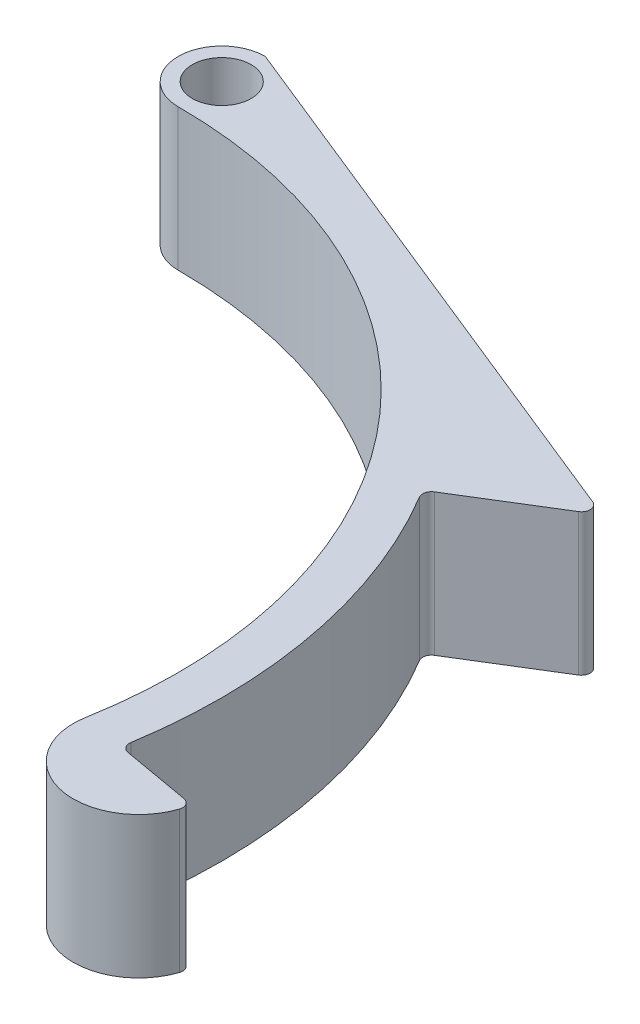
ISO-10303-21;
HEADER;
FILE_DESCRIPTION(('STEP AP214'),'2;1');
FILE_NAME('part.step','',(''),(''),'','','');
FILE_SCHEMA(('AUTOMOTIVE_DESIGN { 1 0 10303 214 1 1 1 1 }'));
ENDSEC;
DATA;
#1=APPLICATION_CONTEXT('core data for automotive mechanical design processes');
#2=APPLICATION_PROTOCOL_DEFINITION('international standard','automotive_design',2000,#1);
#3=PRODUCT_CONTEXT('',#1,'mechanical');
#4=PRODUCT('Part','Part','',(#3));
#5=PRODUCT_RELATED_PRODUCT_CATEGORY('part','',(#4));
#6=PRODUCT_DEFINITION_FORMATION('','',#4);
#7=PRODUCT_DEFINITION_CONTEXT('part definition',#1,'design');
#8=PRODUCT_DEFINITION('design','',#6,#7);
#9=PRODUCT_DEFINITION_SHAPE('','',#8);
#10=(LENGTH_UNIT() NAMED_UNIT(*) SI_UNIT(.MILLI.,.METRE.));
#11=(NAMED_UNIT(*) PLANE_ANGLE_UNIT() SI_UNIT($,.RADIAN.));
#12=(NAMED_UNIT(*) SI_UNIT($,.STERADIAN.) SOLID_ANGLE_UNIT());
#13=UNCERTAINTY_MEASURE_WITH_UNIT(LENGTH_MEASURE(1.E-05),#10,'distance_accuracy_value','');
#14=(GEOMETRIC_REPRESENTATION_CONTEXT(3) GLOBAL_UNCERTAINTY_ASSIGNED_CONTEXT((#13)) GLOBAL_UNIT_ASSIGNED_CONTEXT((#10,
#11,#12)) REPRESENTATION_CONTEXT('',''));
#15=CARTESIAN_POINT('',(0.,0.,0.));
#16=DIRECTION('',(0.,0.,1.));
#17=DIRECTION('',(1.,0.,0.));
#18=AXIS2_PLACEMENT_3D('',#15,#16,#17);
#19=CARTESIAN_POINT('',(0.,13.,0.));
#20=DIRECTION('',(0.,-1.,0.));
#21=DIRECTION('',(0.,0.,-1.));
#22=AXIS2_PLACEMENT_3D('',#19,#20,#21);
#23=CYLINDRICAL_SURFACE('',#22,45.);
#24=CARTESIAN_POINT('',(0.,0.,0.));
#25=DIRECTION('',(0.,1.,0.));
#26=DIRECTION('',(0.,0.,1.));
#27=AXIS2_PLACEMENT_3D('',#24,#25,#26);
#28=CIRCLE('',#27,45.);
#29=CARTESIAN_POINT('',(0.,0.,-45.));
#30=VERTEX_POINT('',#29);
#31=CARTESIAN_POINT('',(44.3163488855494,0.,7.81416799501173));
#32=VERTEX_POINT('',#31);
#33=EDGE_CURVE('E158',#30,#32,#28,.F.);
#34=ORIENTED_EDGE('',*,*,#33,.T.);
#35=DIRECTION('',(0.,-1.,0.));
#36=VECTOR('',#35,1.);
#37=CARTESIAN_POINT('',(44.3163488855494,13.,7.81416799501173));
#38=LINE('',#37,#36);
#39=CARTESIAN_POINT('',(44.3163488855494,13.,7.81416799501173));
#40=VERTEX_POINT('',#39);
#41=EDGE_CURVE('E141',#40,#32,#38,.T.);
#42=ORIENTED_EDGE('',*,*,#41,.F.);
#43=CARTESIAN_POINT('',(0.,13.,0.));
#44=DIRECTION('',(0.,1.,0.));
#45=DIRECTION('',(0.,0.,1.));
#46=AXIS2_PLACEMENT_3D('',#43,#44,#45);
#47=CIRCLE('',#46,45.);
#48=CARTESIAN_POINT('',(0.,13.,-45.));
#49=VERTEX_POINT('',#48);
#50=EDGE_CURVE('E148',#49,#40,#47,.F.);
#51=ORIENTED_EDGE('',*,*,#50,.F.);
#52=DIRECTION('',(0.,-1.,0.));
#53=VECTOR('',#52,1.);
#54=CARTESIAN_POINT('',(0.,13.,-45.));
#55=LINE('',#54,#53);
#56=EDGE_CURVE('E161',#49,#30,#55,.T.);
#57=ORIENTED_EDGE('',*,*,#56,.T.);
#58=EDGE_LOOP('',(#34,#42,#51,#57));
#59=FACE_BOUND('',#58,.T.);
#60=ADVANCED_FACE('F45',(#59),#23,.F.);
#61=CARTESIAN_POINT('',(50.2251954036226,13.,8.85605706101328));
#62=DIRECTION('',(0.,-1.,0.));
#63=DIRECTION('',(0.,0.,-1.));
#64=AXIS2_PLACEMENT_3D('',#61,#62,#63);
#65=CYLINDRICAL_SURFACE('',#64,6.);
#66=CARTESIAN_POINT('',(50.2251954036226,0.,8.85605706101328));
#67=DIRECTION('',(0.,1.,0.));
#68=DIRECTION('',(0.,0.,1.));
#69=AXIS2_PLACEMENT_3D('',#66,#67,#68);
#70=CIRCLE('',#69,6.);
#71=CARTESIAN_POINT('',(55.9034053777983,0.,10.7945955540983));
#72=VERTEX_POINT('',#71);
#73=EDGE_CURVE('E266',#32,#72,#70,.T.);
#74=ORIENTED_EDGE('',*,*,#73,.T.);
#75=DIRECTION('',(0.,-1.,0.));
#76=VECTOR('',#75,1.);
#77=CARTESIAN_POINT('',(55.9034053777983,13.,10.7945955540983));
#78=LINE('',#77,#76);
#79=CARTESIAN_POINT('',(55.9034053777983,13.,10.7945955540983));
#80=VERTEX_POINT('',#79);
#81=EDGE_CURVE('E144',#72,#80,#78,.F.);
#82=ORIENTED_EDGE('',*,*,#81,.T.);
#83=CARTESIAN_POINT('',(50.2251954036226,13.,8.85605706101328));
#84=DIRECTION('',(0.,1.,0.));
#85=DIRECTION('',(0.,0.,1.));
#86=AXIS2_PLACEMENT_3D('',#83,#84,#85);
#87=CIRCLE('',#86,6.);
#88=EDGE_CURVE('E136',#40,#80,#87,.T.);
#89=ORIENTED_EDGE('',*,*,#88,.F.);
#90=ORIENTED_EDGE('',*,*,#41,.T.);
#91=EDGE_LOOP('',(#74,#82,#89,#90));
#92=FACE_BOUND('',#91,.T.);
#93=ADVANCED_FACE('F139',(#92),#65,.T.);
#94=CARTESIAN_POINT('',(0.,13.,0.));
#95=DIRECTION('',(-0.173648177666927,0.,0.984807753012209));
#96=DIRECTION('',(0.984807753012209,0.,0.173648177666927));
#97=AXIS2_PLACEMENT_3D('',#94,#95,#96);
#98=PLANE('',#97);
#99=DIRECTION('',(-0.984807753012209,0.,-0.173648177666927));
#100=VECTOR('',#99,1.);
#101=CARTESIAN_POINT('',(0.,13.,0.));
#102=LINE('',#101,#100);
#103=CARTESIAN_POINT('',(55.2852292567084,13.,9.7482775526105));
#104=VERTEX_POINT('',#103);
#105=CARTESIAN_POINT('',(49.0370976097515,13.,8.6465633642336));
#106=VERTEX_POINT('',#105);
#107=EDGE_CURVE('E147',#104,#106,#102,.T.);
#108=ORIENTED_EDGE('',*,*,#107,.F.);
#109=DIRECTION('',(0.,-1.,0.));
#110=VECTOR('',#109,1.);
#111=CARTESIAN_POINT('',(55.2852292567084,13.,9.7482775526105));
#112=LINE('',#111,#110);
#113=CARTESIAN_POINT('',(55.2852292567084,0.,9.7482775526105));
#114=VERTEX_POINT('',#113);
#115=EDGE_CURVE('E165',#104,#114,#112,.T.);
#116=ORIENTED_EDGE('',*,*,#115,.T.);
#117=DIRECTION('',(-0.984807753012209,0.,-0.173648177666927));
#118=VECTOR('',#117,1.);
#119=CARTESIAN_POINT('',(0.,0.,0.));
#120=LINE('',#119,#118);
#121=CARTESIAN_POINT('',(49.0370976097515,0.,8.6465633642336));
#122=VERTEX_POINT('',#121);
#123=EDGE_CURVE('E240',#114,#122,#120,.T.);
#124=ORIENTED_EDGE('',*,*,#123,.T.);
#125=DIRECTION('',(0.,1.,0.));
#126=VECTOR('',#125,1.);
#127=CARTESIAN_POINT('',(49.0370976097515,13.,8.6465633642336));
#128=LINE('',#127,#126);
#129=EDGE_CURVE('E160',#122,#106,#128,.T.);
#130=ORIENTED_EDGE('',*,*,#129,.T.);
#131=EDGE_LOOP('',(#108,#116,#124,#130));
#132=FACE_BOUND('',#131,.T.);
#133=ADVANCED_FACE('F295',(#132),#98,.F.);
#134=CARTESIAN_POINT('',(0.,13.,0.));
#135=DIRECTION('',(0.,-1.,0.));
#136=DIRECTION('',(0.,0.,-1.));
#137=AXIS2_PLACEMENT_3D('',#134,#135,#136);
#138=CYLINDRICAL_SURFACE('',#137,49.);
#139=CARTESIAN_POINT('',(0.,13.,0.));
#140=DIRECTION('',(0.,1.,0.));
#141=DIRECTION('',(0.,0.,1.));
#142=AXIS2_PLACEMENT_3D('',#139,#140,#141);
#143=CIRCLE('',#142,49.);
#144=CARTESIAN_POINT('',(48.3860399888025,13.,7.73247270942506));
#145=VERTEX_POINT('',#144);
#146=CARTESIAN_POINT('',(42.1148392112088,13.,-25.0467626294103));
#147=VERTEX_POINT('',#146);
#148=EDGE_CURVE('E245',#145,#147,#143,.T.);
#149=ORIENTED_EDGE('',*,*,#148,.F.);
#150=DIRECTION('',(0.,-1.,0.));
#151=VECTOR('',#150,1.);
#152=CARTESIAN_POINT('',(48.3860399888025,13.,7.73247270942506));
#153=LINE('',#152,#151);
#154=CARTESIAN_POINT('',(48.3860399888025,0.,7.73247270942506));
#155=VERTEX_POINT('',#154);
#156=EDGE_CURVE('E194',#145,#155,#153,.T.);
#157=ORIENTED_EDGE('',*,*,#156,.T.);
#158=CARTESIAN_POINT('',(0.,0.,0.));
#159=DIRECTION('',(0.,1.,0.));
#160=DIRECTION('',(0.,0.,1.));
#161=AXIS2_PLACEMENT_3D('',#158,#159,#160);
#162=CIRCLE('',#161,49.);
#163=CARTESIAN_POINT('',(42.1148392112088,0.,-25.0467626294103));
#164=VERTEX_POINT('',#163);
#165=EDGE_CURVE('E228',#155,#164,#162,.T.);
#166=ORIENTED_EDGE('',*,*,#165,.T.);
#167=DIRECTION('',(0.,-1.,0.));
#168=VECTOR('',#167,1.);
#169=CARTESIAN_POINT('',(42.1148392112088,13.,-25.0467626294103));
#170=LINE('',#169,#168);
#171=EDGE_CURVE('E191',#164,#147,#170,.F.);
#172=ORIENTED_EDGE('',*,*,#171,.T.);
#173=EDGE_LOOP('',(#149,#157,#166,#172));
#174=FACE_BOUND('',#173,.T.);
#175=ADVANCED_FACE('F236',(#174),#138,.T.);
#176=CARTESIAN_POINT('',(0.,13.,0.));
#177=DIRECTION('',(0.524899474172595,0.,0.851164227404637));
#178=DIRECTION('',(0.851164227404637,0.,-0.524899474172595));
#179=AXIS2_PLACEMENT_3D('',#176,#177,#178);
#180=PLANE('',#179);
#181=DIRECTION('',(-0.851164227404637,0.,0.524899474172595));
#182=VECTOR('',#181,1.);
#183=CARTESIAN_POINT('',(0.,0.,0.));
#184=LINE('',#183,#182);
#185=CARTESIAN_POINT('',(50.5748997151719,0.,-31.1887382153871));
#186=VERTEX_POINT('',#185);
#187=CARTESIAN_POINT('',(42.3825088434823,0.,-26.1366207481407));
#188=VERTEX_POINT('',#187);
#189=EDGE_CURVE('E230',#186,#188,#184,.T.);
#190=ORIENTED_EDGE('',*,*,#189,.F.);
#191=DIRECTION('',(0.,-1.,0.));
#192=VECTOR('',#191,1.);
#193=CARTESIAN_POINT('',(50.5748997151719,13.,-31.1887382153871));
#194=LINE('',#193,#192);
#195=CARTESIAN_POINT('',(50.5748997151719,13.,-31.1887382153871));
#196=VERTEX_POINT('',#195);
#197=EDGE_CURVE('E213',#186,#196,#194,.F.);
#198=ORIENTED_EDGE('',*,*,#197,.T.);
#199=DIRECTION('',(-0.851164227404637,0.,0.524899474172595));
#200=VECTOR('',#199,1.);
#201=CARTESIAN_POINT('',(0.,13.,0.));
#202=LINE('',#201,#200);
#203=CARTESIAN_POINT('',(42.3825088434823,13.,-26.1366207481407));
#204=VERTEX_POINT('',#203);
#205=EDGE_CURVE('E244',#196,#204,#202,.T.);
#206=ORIENTED_EDGE('',*,*,#205,.T.);
#207=DIRECTION('',(0.,-1.,0.));
#208=VECTOR('',#207,1.);
#209=CARTESIAN_POINT('',(42.3825088434823,13.,-26.1366207481407));
#210=LINE('',#209,#208);
#211=EDGE_CURVE('E209',#204,#188,#210,.T.);
#212=ORIENTED_EDGE('',*,*,#211,.T.);
#213=EDGE_LOOP('',(#190,#198,#206,#212));
#214=FACE_BOUND('',#213,.T.);
#215=ADVANCED_FACE('F247',(#214),#180,.T.);
#216=CARTESIAN_POINT('',(18.4107690922549,13.,-45.5602618405853));
#217=DIRECTION('',(0.374663072776281,0.,-0.927161033422908));
#218=DIRECTION('',(-0.927161033422908,0.,-0.374663072776281));
#219=AXIS2_PLACEMENT_3D('',#216,#217,#218);
#220=PLANE('',#219);
#221=DIRECTION('',(0.927161033422908,0.,0.374663072776281));
#222=VECTOR('',#221,1.);
#223=CARTESIAN_POINT('',(18.4107690922549,0.,-45.5602618405853));
#224=LINE('',#223,#222);
#225=CARTESIAN_POINT('',(0.152578115339287,0.,-52.938343628053));
#226=VERTEX_POINT('',#225);
#227=CARTESIAN_POINT('',(50.4547105940548,0.,-32.6113984240491));
#228=VERTEX_POINT('',#227);
#229=EDGE_CURVE('E274',#226,#228,#224,.T.);
#230=ORIENTED_EDGE('',*,*,#229,.F.);
#231=DIRECTION('',(0.,-1.,0.));
#232=VECTOR('',#231,1.);
#233=CARTESIAN_POINT('',(0.152578115339284,13.,-52.938343628053));
#234=LINE('',#233,#232);
#235=CARTESIAN_POINT('',(0.152578115339287,13.,-52.938343628053));
#236=VERTEX_POINT('',#235);
#237=EDGE_CURVE('E206',#226,#236,#234,.F.);
#238=ORIENTED_EDGE('',*,*,#237,.T.);
#239=DIRECTION('',(0.927161033422908,0.,0.374663072776281));
#240=VECTOR('',#239,1.);
#241=CARTESIAN_POINT('',(18.4107690922549,13.,-45.5602618405853));
#242=LINE('',#241,#240);
#243=CARTESIAN_POINT('',(50.4547105940548,13.,-32.6113984240491));
#244=VERTEX_POINT('',#243);
#245=EDGE_CURVE('E250',#236,#244,#242,.T.);
#246=ORIENTED_EDGE('',*,*,#245,.T.);
#247=DIRECTION('',(0.,-1.,0.));
#248=VECTOR('',#247,1.);
#249=CARTESIAN_POINT('',(50.4547105940548,13.,-32.6113984240491));
#250=LINE('',#249,#248);
#251=EDGE_CURVE('E202',#244,#228,#250,.T.);
#252=ORIENTED_EDGE('',*,*,#251,.T.);
#253=EDGE_LOOP('',(#230,#238,#246,#252));
#254=FACE_BOUND('',#253,.T.);
#255=ADVANCED_FACE('F306',(#254),#220,.T.);
#256=CARTESIAN_POINT('',(0.,13.,-49.));
#257=DIRECTION('',(0.,-1.,0.));
#258=DIRECTION('',(0.,0.,-1.));
#259=AXIS2_PLACEMENT_3D('',#256,#257,#258);
#260=CYLINDRICAL_SURFACE('',#259,2.7);
#261=CARTESIAN_POINT('',(0.,13.,-49.));
#262=DIRECTION('',(0.,1.,0.));
#263=DIRECTION('',(0.,0.,1.));
#264=AXIS2_PLACEMENT_3D('',#261,#262,#263);
#265=CIRCLE('',#264,2.7);
#266=CARTESIAN_POINT('',(0.,13.,-46.3));
#267=VERTEX_POINT('',#266);
#268=EDGE_CURVE('E155',#267,#267,#265,.T.);
#269=ORIENTED_EDGE('',*,*,#268,.T.);
#270=EDGE_LOOP('',(#269));
#271=FACE_BOUND('',#270,.T.);
#272=CARTESIAN_POINT('',(0.,0.,-49.));
#273=DIRECTION('',(0.,1.,0.));
#274=DIRECTION('',(0.,0.,1.));
#275=AXIS2_PLACEMENT_3D('',#272,#273,#274);
#276=CIRCLE('',#275,2.7);
#277=CARTESIAN_POINT('',(0.,0.,-46.3));
#278=VERTEX_POINT('',#277);
#279=EDGE_CURVE('E260',#278,#278,#276,.T.);
#280=ORIENTED_EDGE('',*,*,#279,.F.);
#281=EDGE_LOOP('',(#280));
#282=FACE_BOUND('',#281,.T.);
#283=ADVANCED_FACE('F324',(#271,#282),#260,.F.);
#284=CARTESIAN_POINT('',(0.,13.,-49.));
#285=DIRECTION('',(0.,-1.,0.));
#286=DIRECTION('',(0.,0.,-1.));
#287=AXIS2_PLACEMENT_3D('',#284,#285,#286);
#288=CYLINDRICAL_SURFACE('',#287,4.);
#289=CARTESIAN_POINT('',(0.,13.,-49.));
#290=DIRECTION('',(0.,1.,0.));
#291=DIRECTION('',(0.,0.,1.));
#292=AXIS2_PLACEMENT_3D('',#289,#290,#291);
#293=CIRCLE('',#292,4.);
#294=CARTESIAN_POINT('',(-0.183940428602176,13.,-52.9957685016434));
#295=VERTEX_POINT('',#294);
#296=EDGE_CURVE('E152',#49,#295,#293,.F.);
#297=ORIENTED_EDGE('',*,*,#296,.T.);
#298=DIRECTION('',(0.,-1.,0.));
#299=VECTOR('',#298,1.);
#300=CARTESIAN_POINT('',(-0.183940428602176,13.,-52.9957685016434));
#301=LINE('',#300,#299);
#302=CARTESIAN_POINT('',(-0.183940428602176,0.,-52.9957685016434));
#303=VERTEX_POINT('',#302);
#304=EDGE_CURVE('E198',#295,#303,#301,.T.);
#305=ORIENTED_EDGE('',*,*,#304,.T.);
#306=CARTESIAN_POINT('',(0.,0.,-49.));
#307=DIRECTION('',(0.,1.,0.));
#308=DIRECTION('',(0.,0.,1.));
#309=AXIS2_PLACEMENT_3D('',#306,#307,#308);
#310=CIRCLE('',#309,4.);
#311=EDGE_CURVE('E277',#30,#303,#310,.F.);
#312=ORIENTED_EDGE('',*,*,#311,.F.);
#313=ORIENTED_EDGE('',*,*,#56,.F.);
#314=EDGE_LOOP('',(#297,#305,#312,#313));
#315=FACE_BOUND('',#314,.T.);
#316=ADVANCED_FACE('F299',(#315),#288,.T.);
#317=CARTESIAN_POINT('',(0.,13.,0.));
#318=DIRECTION('',(0.,1.,0.));
#319=DIRECTION('',(0.,0.,1.));
#320=AXIS2_PLACEMENT_3D('',#317,#318,#319);
#321=PLANE('',#320);
#322=ORIENTED_EDGE('',*,*,#268,.F.);
#323=EDGE_LOOP('',(#322));
#324=FACE_BOUND('',#323,.T.);
#325=ORIENTED_EDGE('',*,*,#88,.T.);
#326=CARTESIAN_POINT('',(55.1463107145748,13.,10.5361237550203));
#327=DIRECTION('',(0.,1.,0.));
#328=DIRECTION('',(0.,0.,1.));
#329=AXIS2_PLACEMENT_3D('',#326,#327,#328);
#330=CIRCLE('',#329,0.8);
#331=EDGE_CURVE('E188',#80,#104,#330,.T.);
#332=ORIENTED_EDGE('',*,*,#331,.T.);
#333=ORIENTED_EDGE('',*,*,#107,.T.);
#334=CARTESIAN_POINT('',(49.176016151885,13.,7.85871716182383));
#335=DIRECTION('',(0.,1.,0.));
#336=DIRECTION('',(0.,0.,1.));
#337=AXIS2_PLACEMENT_3D('',#334,#335,#336);
#338=CIRCLE('',#337,0.8);
#339=EDGE_CURVE('E219',#106,#145,#338,.F.);
#340=ORIENTED_EDGE('',*,*,#339,.T.);
#341=ORIENTED_EDGE('',*,*,#148,.T.);
#342=CARTESIAN_POINT('',(42.8024284228204,13.,-25.455689366217));
#343=DIRECTION('',(0.,1.,0.));
#344=DIRECTION('',(0.,0.,1.));
#345=AXIS2_PLACEMENT_3D('',#342,#343,#344);
#346=CIRCLE('',#345,0.8);
#347=EDGE_CURVE('E11',#147,#204,#346,.F.);
#348=ORIENTED_EDGE('',*,*,#347,.T.);
#349=ORIENTED_EDGE('',*,*,#205,.F.);
#350=CARTESIAN_POINT('',(50.1549801358338,13.,-31.8696695973108));
#351=DIRECTION('',(0.,1.,0.));
#352=DIRECTION('',(0.,0.,1.));
#353=AXIS2_PLACEMENT_3D('',#350,#351,#352);
#354=CIRCLE('',#353,0.8);
#355=EDGE_CURVE('E67',#196,#244,#354,.T.);
#356=ORIENTED_EDGE('',*,*,#355,.T.);
#357=ORIENTED_EDGE('',*,*,#245,.F.);
#358=CARTESIAN_POINT('',(-0.147152342881741,13.,-52.1966148013147));
#359=DIRECTION('',(0.,1.,0.));
#360=DIRECTION('',(0.,0.,1.));
#361=AXIS2_PLACEMENT_3D('',#358,#359,#360);
#362=CIRCLE('',#361,0.8);
#363=EDGE_CURVE('E61',#236,#295,#362,.T.);
#364=ORIENTED_EDGE('',*,*,#363,.T.);
#365=ORIENTED_EDGE('',*,*,#296,.F.);
#366=ORIENTED_EDGE('',*,*,#50,.T.);
#367=EDGE_LOOP('',(#325,#332,#333,#340,#341,#348,#349,#356,#357,#364,#365,#366));
#368=FACE_BOUND('',#367,.T.);
#369=ADVANCED_FACE('F151',(#324,#368),#321,.T.);
#370=CARTESIAN_POINT('',(0.,0.,0.));
#371=DIRECTION('',(0.,1.,0.));
#372=DIRECTION('',(0.,0.,1.));
#373=AXIS2_PLACEMENT_3D('',#370,#371,#372);
#374=PLANE('',#373);
#375=ORIENTED_EDGE('',*,*,#279,.T.);
#376=EDGE_LOOP('',(#375));
#377=FACE_BOUND('',#376,.T.);
#378=ORIENTED_EDGE('',*,*,#123,.F.);
#379=CARTESIAN_POINT('',(55.1463107145748,0.,10.5361237550203));
#380=DIRECTION('',(0.,1.,0.));
#381=DIRECTION('',(0.,0.,1.));
#382=AXIS2_PLACEMENT_3D('',#379,#380,#381);
#383=CIRCLE('',#382,0.8);
#384=EDGE_CURVE('E179',#114,#72,#383,.F.);
#385=ORIENTED_EDGE('',*,*,#384,.T.);
#386=ORIENTED_EDGE('',*,*,#73,.F.);
#387=ORIENTED_EDGE('',*,*,#33,.F.);
#388=ORIENTED_EDGE('',*,*,#311,.T.);
#389=CARTESIAN_POINT('',(-0.147152342881741,0.,-52.1966148013147));
#390=DIRECTION('',(0.,1.,0.));
#391=DIRECTION('',(0.,0.,1.));
#392=AXIS2_PLACEMENT_3D('',#389,#390,#391);
#393=CIRCLE('',#392,0.8);
#394=EDGE_CURVE('E176',#303,#226,#393,.F.);
#395=ORIENTED_EDGE('',*,*,#394,.T.);
#396=ORIENTED_EDGE('',*,*,#229,.T.);
#397=CARTESIAN_POINT('',(50.1549801358338,0.,-31.8696695973108));
#398=DIRECTION('',(0.,1.,0.));
#399=DIRECTION('',(0.,0.,1.));
#400=AXIS2_PLACEMENT_3D('',#397,#398,#399);
#401=CIRCLE('',#400,0.8);
#402=EDGE_CURVE('E173',#228,#186,#401,.F.);
#403=ORIENTED_EDGE('',*,*,#402,.T.);
#404=ORIENTED_EDGE('',*,*,#189,.T.);
#405=CARTESIAN_POINT('',(42.8024284228204,0.,-25.455689366217));
#406=DIRECTION('',(0.,1.,0.));
#407=DIRECTION('',(0.,0.,1.));
#408=AXIS2_PLACEMENT_3D('',#405,#406,#407);
#409=CIRCLE('',#408,0.8);
#410=EDGE_CURVE('E54',#188,#164,#409,.T.);
#411=ORIENTED_EDGE('',*,*,#410,.T.);
#412=ORIENTED_EDGE('',*,*,#165,.F.);
#413=CARTESIAN_POINT('',(49.176016151885,0.,7.85871716182383));
#414=DIRECTION('',(0.,1.,0.));
#415=DIRECTION('',(0.,0.,1.));
#416=AXIS2_PLACEMENT_3D('',#413,#414,#415);
#417=CIRCLE('',#416,0.8);
#418=EDGE_CURVE('E216',#155,#122,#417,.T.);
#419=ORIENTED_EDGE('',*,*,#418,.T.);
#420=EDGE_LOOP('',(#378,#385,#386,#387,#388,#395,#396,#403,#404,#411,#412,#419));
#421=FACE_BOUND('',#420,.T.);
#422=ADVANCED_FACE('F227',(#377,#421),#374,.F.);
#423=CARTESIAN_POINT('',(55.1463107145748,13.,10.5361237550203));
#424=DIRECTION('',(0.,-1.,0.));
#425=DIRECTION('',(0.,0.,-1.));
#426=AXIS2_PLACEMENT_3D('',#423,#424,#425);
#427=CYLINDRICAL_SURFACE('',#426,0.8);
#428=ORIENTED_EDGE('',*,*,#331,.F.);
#429=ORIENTED_EDGE('',*,*,#81,.F.);
#430=ORIENTED_EDGE('',*,*,#384,.F.);
#431=ORIENTED_EDGE('',*,*,#115,.F.);
#432=EDGE_LOOP('',(#428,#429,#430,#431));
#433=FACE_BOUND('',#432,.T.);
#434=ADVANCED_FACE('F297',(#433),#427,.T.);
#435=CARTESIAN_POINT('',(49.176016151885,13.,7.85871716182383));
#436=DIRECTION('',(0.,-1.,0.));
#437=DIRECTION('',(0.,0.,-1.));
#438=AXIS2_PLACEMENT_3D('',#435,#436,#437);
#439=CYLINDRICAL_SURFACE('',#438,0.8);
#440=ORIENTED_EDGE('',*,*,#339,.F.);
#441=ORIENTED_EDGE('',*,*,#129,.F.);
#442=ORIENTED_EDGE('',*,*,#418,.F.);
#443=ORIENTED_EDGE('',*,*,#156,.F.);
#444=EDGE_LOOP('',(#440,#441,#442,#443));
#445=FACE_BOUND('',#444,.T.);
#446=ADVANCED_FACE('F294',(#445),#439,.F.);
#447=CARTESIAN_POINT('',(-0.147152342881741,13.,-52.1966148013147));
#448=DIRECTION('',(0.,-1.,0.));
#449=DIRECTION('',(0.,0.,-1.));
#450=AXIS2_PLACEMENT_3D('',#447,#448,#449);
#451=CYLINDRICAL_SURFACE('',#450,0.8);
#452=ORIENTED_EDGE('',*,*,#363,.F.);
#453=ORIENTED_EDGE('',*,*,#237,.F.);
#454=ORIENTED_EDGE('',*,*,#394,.F.);
#455=ORIENTED_EDGE('',*,*,#304,.F.);
#456=EDGE_LOOP('',(#452,#453,#454,#455));
#457=FACE_BOUND('',#456,.T.);
#458=ADVANCED_FACE('F302',(#457),#451,.T.);
#459=CARTESIAN_POINT('',(50.1549801358338,13.,-31.8696695973108));
#460=DIRECTION('',(0.,-1.,0.));
#461=DIRECTION('',(0.,0.,-1.));
#462=AXIS2_PLACEMENT_3D('',#459,#460,#461);
#463=CYLINDRICAL_SURFACE('',#462,0.8);
#464=ORIENTED_EDGE('',*,*,#355,.F.);
#465=ORIENTED_EDGE('',*,*,#197,.F.);
#466=ORIENTED_EDGE('',*,*,#402,.F.);
#467=ORIENTED_EDGE('',*,*,#251,.F.);
#468=EDGE_LOOP('',(#464,#465,#466,#467));
#469=FACE_BOUND('',#468,.T.);
#470=ADVANCED_FACE('F309',(#469),#463,.T.);
#471=CARTESIAN_POINT('',(42.8024284228204,13.,-25.455689366217));
#472=DIRECTION('',(0.,-1.,0.));
#473=DIRECTION('',(0.,0.,-1.));
#474=AXIS2_PLACEMENT_3D('',#471,#472,#473);
#475=CYLINDRICAL_SURFACE('',#474,0.8);
#476=ORIENTED_EDGE('',*,*,#347,.F.);
#477=ORIENTED_EDGE('',*,*,#171,.F.);
#478=ORIENTED_EDGE('',*,*,#410,.F.);
#479=ORIENTED_EDGE('',*,*,#211,.F.);
#480=EDGE_LOOP('',(#476,#477,#478,#479));
#481=FACE_BOUND('',#480,.T.);
#482=ADVANCED_FACE('F47',(#481),#475,.F.);
#483=CLOSED_SHELL('',(#60,#93,#133,#175,#215,#255,#283,#316,#369,#422,#434,#446,#458,#470,#482));
#484=MANIFOLD_SOLID_BREP('B2',#483);
#485=ADVANCED_BREP_SHAPE_REPRESENTATION('',(#18,#484),#14);
#486=SHAPE_DEFINITION_REPRESENTATION(#9,#485);
ENDSEC;
END-ISO-10303-21;
